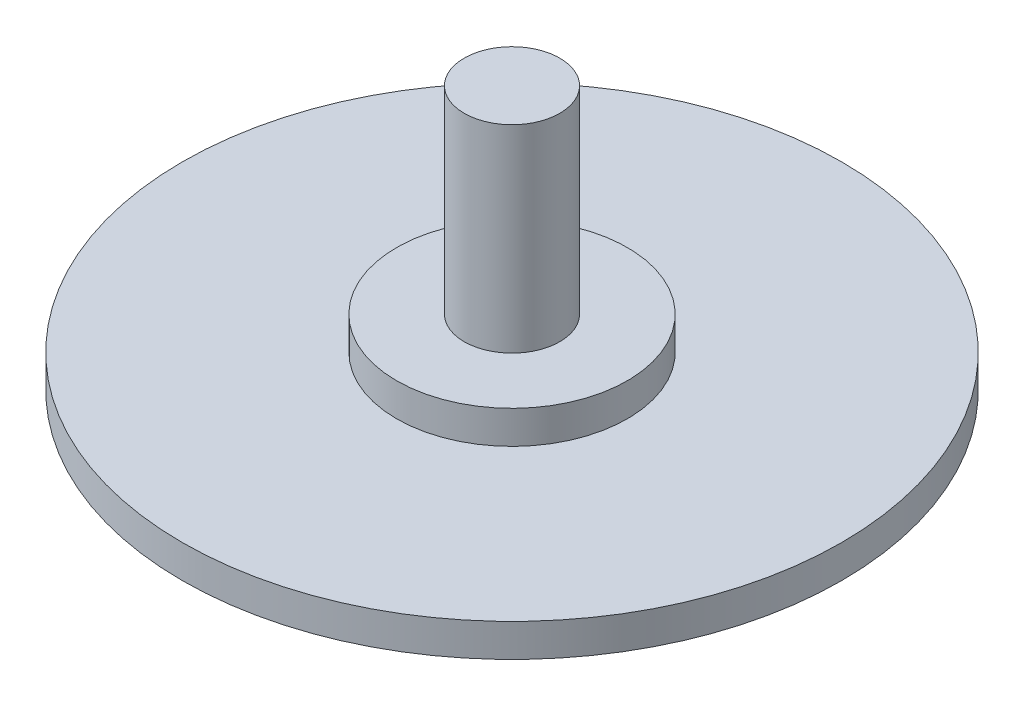
ISO-10303-21;
HEADER;
FILE_DESCRIPTION(('STEP AP214'),'2;1');
FILE_NAME('part.step','',(''),(''),'','','');
FILE_SCHEMA(('AUTOMOTIVE_DESIGN { 1 0 10303 214 1 1 1 1 }'));
ENDSEC;
DATA;
#1=APPLICATION_CONTEXT('core data for automotive mechanical design processes');
#2=APPLICATION_PROTOCOL_DEFINITION('international standard','automotive_design',2000,#1);
#3=PRODUCT_CONTEXT('',#1,'mechanical');
#4=PRODUCT('Part','Part','',(#3));
#5=PRODUCT_RELATED_PRODUCT_CATEGORY('part','',(#4));
#6=PRODUCT_DEFINITION_FORMATION('','',#4);
#7=PRODUCT_DEFINITION_CONTEXT('part definition',#1,'design');
#8=PRODUCT_DEFINITION('design','',#6,#7);
#9=PRODUCT_DEFINITION_SHAPE('','',#8);
#10=(LENGTH_UNIT() NAMED_UNIT(*) SI_UNIT(.MILLI.,.METRE.));
#11=(NAMED_UNIT(*) PLANE_ANGLE_UNIT() SI_UNIT($,.RADIAN.));
#12=(NAMED_UNIT(*) SI_UNIT($,.STERADIAN.) SOLID_ANGLE_UNIT());
#13=UNCERTAINTY_MEASURE_WITH_UNIT(LENGTH_MEASURE(1.E-05),#10,'distance_accuracy_value','');
#14=(GEOMETRIC_REPRESENTATION_CONTEXT(3) GLOBAL_UNCERTAINTY_ASSIGNED_CONTEXT((#13)) GLOBAL_UNIT_ASSIGNED_CONTEXT((#10,
#11,#12)) REPRESENTATION_CONTEXT('',''));
#15=CARTESIAN_POINT('',(0.,0.,0.));
#16=DIRECTION('',(0.,0.,1.));
#17=DIRECTION('',(1.,0.,0.));
#18=AXIS2_PLACEMENT_3D('',#15,#16,#17);
#19=CARTESIAN_POINT('',(0.,1.,0.));
#20=DIRECTION('',(0.,-1.,0.));
#21=DIRECTION('',(0.,0.,-1.));
#22=AXIS2_PLACEMENT_3D('',#19,#20,#21);
#23=CYLINDRICAL_SURFACE('',#22,10.);
#24=CARTESIAN_POINT('',(0.,1.,0.));
#25=DIRECTION('',(0.,1.,0.));
#26=DIRECTION('',(0.,0.,1.));
#27=AXIS2_PLACEMENT_3D('',#24,#25,#26);
#28=CIRCLE('',#27,10.);
#29=CARTESIAN_POINT('',(0.,1.,10.));
#30=VERTEX_POINT('',#29);
#31=EDGE_CURVE('E10',#30,#30,#28,.T.);
#32=ORIENTED_EDGE('',*,*,#31,.F.);
#33=EDGE_LOOP('',(#32));
#34=FACE_BOUND('',#33,.T.);
#35=CARTESIAN_POINT('',(0.,0.,0.));
#36=DIRECTION('',(0.,1.,0.));
#37=DIRECTION('',(0.,0.,1.));
#38=AXIS2_PLACEMENT_3D('',#35,#36,#37);
#39=CIRCLE('',#38,10.);
#40=CARTESIAN_POINT('',(0.,0.,10.));
#41=VERTEX_POINT('',#40);
#42=EDGE_CURVE('E38',#41,#41,#39,.T.);
#43=ORIENTED_EDGE('',*,*,#42,.T.);
#44=EDGE_LOOP('',(#43));
#45=FACE_BOUND('',#44,.T.);
#46=ADVANCED_FACE('F31',(#34,#45),#23,.T.);
#47=CARTESIAN_POINT('',(0.,1.,0.));
#48=DIRECTION('',(0.,1.,0.));
#49=DIRECTION('',(0.,0.,1.));
#50=AXIS2_PLACEMENT_3D('',#47,#48,#49);
#51=PLANE('',#50);
#52=CARTESIAN_POINT('',(0.,1.,0.));
#53=DIRECTION('',(0.,1.,0.));
#54=DIRECTION('',(0.,0.,1.));
#55=AXIS2_PLACEMENT_3D('',#52,#53,#54);
#56=CIRCLE('',#55,3.5);
#57=CARTESIAN_POINT('',(0.,1.,3.5));
#58=VERTEX_POINT('',#57);
#59=EDGE_CURVE('E47',#58,#58,#56,.T.);
#60=ORIENTED_EDGE('',*,*,#59,.F.);
#61=EDGE_LOOP('',(#60));
#62=FACE_BOUND('',#61,.T.);
#63=ORIENTED_EDGE('',*,*,#31,.T.);
#64=EDGE_LOOP('',(#63));
#65=FACE_BOUND('',#64,.T.);
#66=ADVANCED_FACE('F75',(#62,#65),#51,.T.);
#67=CARTESIAN_POINT('',(0.,0.,0.));
#68=DIRECTION('',(0.,1.,0.));
#69=DIRECTION('',(0.,0.,1.));
#70=AXIS2_PLACEMENT_3D('',#67,#68,#69);
#71=PLANE('',#70);
#72=ORIENTED_EDGE('',*,*,#42,.F.);
#73=EDGE_LOOP('',(#72));
#74=FACE_BOUND('',#73,.T.);
#75=ADVANCED_FACE('F71',(#74),#71,.F.);
#76=CARTESIAN_POINT('',(0.,2.,0.));
#77=DIRECTION('',(0.,-1.,0.));
#78=DIRECTION('',(0.,0.,-1.));
#79=AXIS2_PLACEMENT_3D('',#76,#77,#78);
#80=CYLINDRICAL_SURFACE('',#79,3.5);
#81=CARTESIAN_POINT('',(0.,2.,0.));
#82=DIRECTION('',(0.,1.,0.));
#83=DIRECTION('',(0.,0.,1.));
#84=AXIS2_PLACEMENT_3D('',#81,#82,#83);
#85=CIRCLE('',#84,3.5);
#86=CARTESIAN_POINT('',(0.,2.,3.5));
#87=VERTEX_POINT('',#86);
#88=EDGE_CURVE('E50',#87,#87,#85,.T.);
#89=ORIENTED_EDGE('',*,*,#88,.F.);
#90=EDGE_LOOP('',(#89));
#91=FACE_BOUND('',#90,.T.);
#92=ORIENTED_EDGE('',*,*,#59,.T.);
#93=EDGE_LOOP('',(#92));
#94=FACE_BOUND('',#93,.T.);
#95=ADVANCED_FACE('F63',(#91,#94),#80,.T.);
#96=CARTESIAN_POINT('',(0.,2.,0.));
#97=DIRECTION('',(0.,1.,0.));
#98=DIRECTION('',(0.,0.,1.));
#99=AXIS2_PLACEMENT_3D('',#96,#97,#98);
#100=PLANE('',#99);
#101=CARTESIAN_POINT('',(0.,2.,0.));
#102=DIRECTION('',(0.,1.,0.));
#103=DIRECTION('',(0.,0.,1.));
#104=AXIS2_PLACEMENT_3D('',#101,#102,#103);
#105=CIRCLE('',#104,1.45);
#106=CARTESIAN_POINT('',(0.,2.,1.45));
#107=VERTEX_POINT('',#106);
#108=EDGE_CURVE('E34',#107,#107,#105,.T.);
#109=ORIENTED_EDGE('',*,*,#108,.F.);
#110=EDGE_LOOP('',(#109));
#111=FACE_BOUND('',#110,.T.);
#112=ORIENTED_EDGE('',*,*,#88,.T.);
#113=EDGE_LOOP('',(#112));
#114=FACE_BOUND('',#113,.T.);
#115=ADVANCED_FACE('F60',(#111,#114),#100,.T.);
#116=CARTESIAN_POINT('',(0.,8.,0.));
#117=DIRECTION('',(0.,1.,0.));
#118=DIRECTION('',(0.,0.,1.));
#119=AXIS2_PLACEMENT_3D('',#116,#117,#118);
#120=PLANE('',#119);
#121=CARTESIAN_POINT('',(0.,8.,0.));
#122=DIRECTION('',(0.,1.,0.));
#123=DIRECTION('',(0.,0.,1.));
#124=AXIS2_PLACEMENT_3D('',#121,#122,#123);
#125=CIRCLE('',#124,1.45);
#126=CARTESIAN_POINT('',(0.,8.,1.45));
#127=VERTEX_POINT('',#126);
#128=EDGE_CURVE('E43',#127,#127,#125,.T.);
#129=ORIENTED_EDGE('',*,*,#128,.T.);
#130=EDGE_LOOP('',(#129));
#131=FACE_BOUND('',#130,.T.);
#132=ADVANCED_FACE('F62',(#131),#120,.T.);
#133=CARTESIAN_POINT('',(0.,8.,0.));
#134=DIRECTION('',(0.,-1.,0.));
#135=DIRECTION('',(0.,0.,-1.));
#136=AXIS2_PLACEMENT_3D('',#133,#134,#135);
#137=CYLINDRICAL_SURFACE('',#136,1.45);
#138=ORIENTED_EDGE('',*,*,#108,.T.);
#139=EDGE_LOOP('',(#138));
#140=FACE_BOUND('',#139,.T.);
#141=ORIENTED_EDGE('',*,*,#128,.F.);
#142=EDGE_LOOP('',(#141));
#143=FACE_BOUND('',#142,.T.);
#144=ADVANCED_FACE('F57',(#140,#143),#137,.T.);
#145=CLOSED_SHELL('',(#46,#66,#75,#95,#115,#132,#144));
#146=MANIFOLD_SOLID_BREP('B2',#145);
#147=ADVANCED_BREP_SHAPE_REPRESENTATION('',(#18,#146),#14);
#148=SHAPE_DEFINITION_REPRESENTATION(#9,#147);
ENDSEC;
END-ISO-10303-21;
